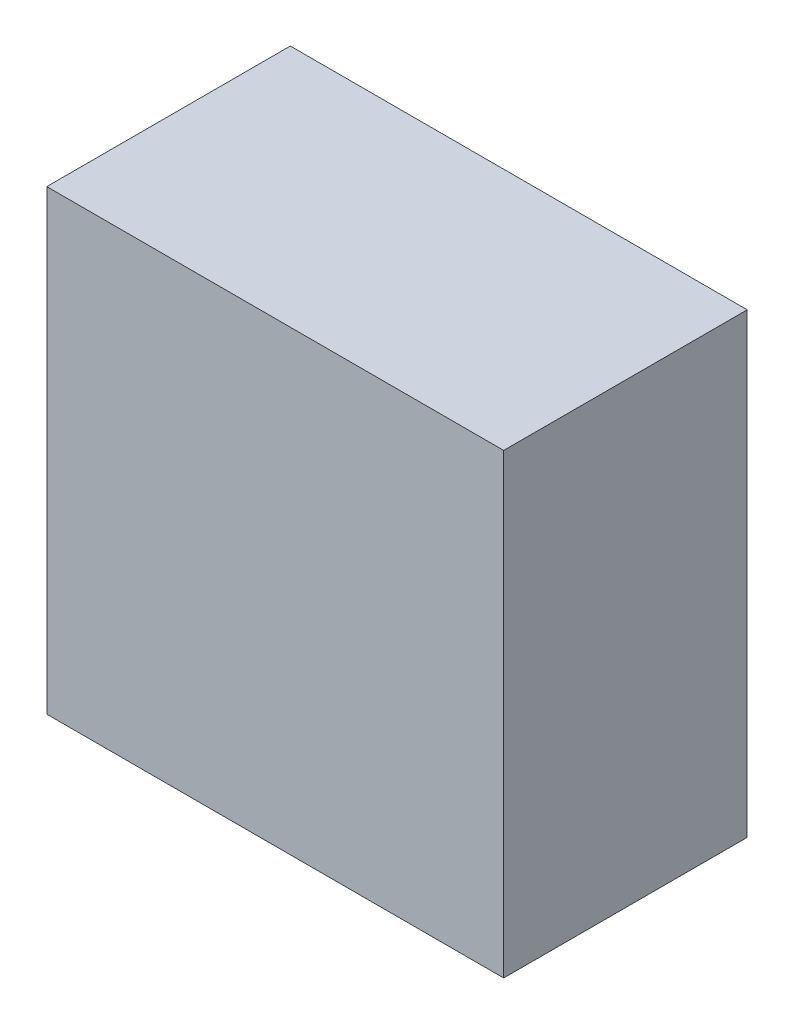
ISO-10303-21;
HEADER;
FILE_DESCRIPTION(('STEP AP214'),'2;1');
FILE_NAME('part.step','',(''),(''),'','','');
FILE_SCHEMA(('AUTOMOTIVE_DESIGN { 1 0 10303 214 1 1 1 1 }'));
ENDSEC;
DATA;
#1=APPLICATION_CONTEXT('core data for automotive mechanical design processes');
#2=APPLICATION_PROTOCOL_DEFINITION('international standard','automotive_design',2000,#1);
#3=PRODUCT_CONTEXT('',#1,'mechanical');
#4=PRODUCT('Part','Part','',(#3));
#5=PRODUCT_RELATED_PRODUCT_CATEGORY('part','',(#4));
#6=PRODUCT_DEFINITION_FORMATION('','',#4);
#7=PRODUCT_DEFINITION_CONTEXT('part definition',#1,'design');
#8=PRODUCT_DEFINITION('design','',#6,#7);
#9=PRODUCT_DEFINITION_SHAPE('','',#8);
#10=(LENGTH_UNIT() NAMED_UNIT(*) SI_UNIT(.MILLI.,.METRE.));
#11=(NAMED_UNIT(*) PLANE_ANGLE_UNIT() SI_UNIT($,.RADIAN.));
#12=(NAMED_UNIT(*) SI_UNIT($,.STERADIAN.) SOLID_ANGLE_UNIT());
#13=UNCERTAINTY_MEASURE_WITH_UNIT(LENGTH_MEASURE(1.E-05),#10,'distance_accuracy_value','');
#14=(GEOMETRIC_REPRESENTATION_CONTEXT(3) GLOBAL_UNCERTAINTY_ASSIGNED_CONTEXT((#13)) GLOBAL_UNIT_ASSIGNED_CONTEXT((#10,
#11,#12)) REPRESENTATION_CONTEXT('',''));
#15=CARTESIAN_POINT('',(0.,0.,0.));
#16=DIRECTION('',(0.,0.,1.));
#17=DIRECTION('',(1.,0.,0.));
#18=AXIS2_PLACEMENT_3D('',#15,#16,#17);
#19=CARTESIAN_POINT('',(0.499999,-0.499999,0.53300122));
#20=DIRECTION('',(0.,0.,1.));
#21=DIRECTION('',(1.,0.,0.));
#22=AXIS2_PLACEMENT_3D('',#19,#20,#21);
#23=PLANE('',#22);
#24=DIRECTION('',(-1.,0.,0.));
#25=VECTOR('',#24,1.);
#26=CARTESIAN_POINT('',(0.499999,-0.499999,0.53300122));
#27=LINE('',#26,#25);
#28=CARTESIAN_POINT('',(0.499999,-0.499999,0.53300122));
#29=VERTEX_POINT('',#28);
#30=CARTESIAN_POINT('',(-0.499999,-0.499999,0.53300122));
#31=VERTEX_POINT('',#30);
#32=EDGE_CURVE('E91',#29,#31,#27,.T.);
#33=ORIENTED_EDGE('',*,*,#32,.F.);
#34=DIRECTION('',(0.,-1.,0.));
#35=VECTOR('',#34,1.);
#36=CARTESIAN_POINT('',(0.499999,0.499999,0.53300122));
#37=LINE('',#36,#35);
#38=CARTESIAN_POINT('',(0.499999,0.499999,0.53300122));
#39=VERTEX_POINT('',#38);
#40=EDGE_CURVE('E28',#39,#29,#37,.T.);
#41=ORIENTED_EDGE('',*,*,#40,.F.);
#42=DIRECTION('',(1.,0.,0.));
#43=VECTOR('',#42,1.);
#44=CARTESIAN_POINT('',(-0.499999,0.499999,0.53300122));
#45=LINE('',#44,#43);
#46=CARTESIAN_POINT('',(-0.499999,0.499999,0.53300122));
#47=VERTEX_POINT('',#46);
#48=EDGE_CURVE('E84',#47,#39,#45,.T.);
#49=ORIENTED_EDGE('',*,*,#48,.F.);
#50=DIRECTION('',(0.,1.,0.));
#51=VECTOR('',#50,1.);
#52=CARTESIAN_POINT('',(-0.499999,-0.499999,0.53300122));
#53=LINE('',#52,#51);
#54=EDGE_CURVE('E66',#31,#47,#53,.T.);
#55=ORIENTED_EDGE('',*,*,#54,.F.);
#56=EDGE_LOOP('',(#33,#41,#49,#55));
#57=FACE_BOUND('',#56,.T.);
#58=ADVANCED_FACE('F17',(#57),#23,.T.);
#59=CARTESIAN_POINT('',(0.499999,-0.499999,0.));
#60=DIRECTION('',(0.,0.,1.));
#61=DIRECTION('',(1.,0.,0.));
#62=AXIS2_PLACEMENT_3D('',#59,#60,#61);
#63=PLANE('',#62);
#64=DIRECTION('',(-1.,0.,0.));
#65=VECTOR('',#64,1.);
#66=CARTESIAN_POINT('',(0.499999,-0.499999,0.));
#67=LINE('',#66,#65);
#68=CARTESIAN_POINT('',(0.499999,-0.499999,0.));
#69=VERTEX_POINT('',#68);
#70=CARTESIAN_POINT('',(-0.499999,-0.499999,0.));
#71=VERTEX_POINT('',#70);
#72=EDGE_CURVE('E21',#69,#71,#67,.T.);
#73=ORIENTED_EDGE('',*,*,#72,.T.);
#74=DIRECTION('',(0.,1.,0.));
#75=VECTOR('',#74,1.);
#76=CARTESIAN_POINT('',(-0.499999,-0.499999,0.));
#77=LINE('',#76,#75);
#78=CARTESIAN_POINT('',(-0.499999,0.499999,0.));
#79=VERTEX_POINT('',#78);
#80=EDGE_CURVE('E74',#71,#79,#77,.T.);
#81=ORIENTED_EDGE('',*,*,#80,.T.);
#82=DIRECTION('',(1.,0.,0.));
#83=VECTOR('',#82,1.);
#84=CARTESIAN_POINT('',(-0.499999,0.499999,0.));
#85=LINE('',#84,#83);
#86=CARTESIAN_POINT('',(0.499999,0.499999,0.));
#87=VERTEX_POINT('',#86);
#88=EDGE_CURVE('E105',#79,#87,#85,.T.);
#89=ORIENTED_EDGE('',*,*,#88,.T.);
#90=DIRECTION('',(0.,-1.,0.));
#91=VECTOR('',#90,1.);
#92=CARTESIAN_POINT('',(0.499999,0.499999,0.));
#93=LINE('',#92,#91);
#94=EDGE_CURVE('E11',#87,#69,#93,.T.);
#95=ORIENTED_EDGE('',*,*,#94,.T.);
#96=EDGE_LOOP('',(#73,#81,#89,#95));
#97=FACE_BOUND('',#96,.T.);
#98=ADVANCED_FACE('F19',(#97),#63,.F.);
#99=CARTESIAN_POINT('',(0.499999,0.499999,0.));
#100=DIRECTION('',(1.,0.,0.));
#101=DIRECTION('',(0.,1.,0.));
#102=AXIS2_PLACEMENT_3D('',#99,#100,#101);
#103=PLANE('',#102);
#104=DIRECTION('',(0.,0.,1.));
#105=VECTOR('',#104,1.);
#106=CARTESIAN_POINT('',(0.499999,0.499999,0.));
#107=LINE('',#106,#105);
#108=EDGE_CURVE('E114',#87,#39,#107,.T.);
#109=ORIENTED_EDGE('',*,*,#108,.T.);
#110=ORIENTED_EDGE('',*,*,#40,.T.);
#111=DIRECTION('',(0.,0.,1.));
#112=VECTOR('',#111,1.);
#113=CARTESIAN_POINT('',(0.499999,-0.499999,0.));
#114=LINE('',#113,#112);
#115=EDGE_CURVE('E98',#69,#29,#114,.T.);
#116=ORIENTED_EDGE('',*,*,#115,.F.);
#117=ORIENTED_EDGE('',*,*,#94,.F.);
#118=EDGE_LOOP('',(#109,#110,#116,#117));
#119=FACE_BOUND('',#118,.T.);
#120=ADVANCED_FACE('F126',(#119),#103,.T.);
#121=CARTESIAN_POINT('',(-0.499999,0.499999,0.));
#122=DIRECTION('',(0.,1.,0.));
#123=DIRECTION('',(1.,0.,0.));
#124=AXIS2_PLACEMENT_3D('',#121,#122,#123);
#125=PLANE('',#124);
#126=DIRECTION('',(0.,0.,1.));
#127=VECTOR('',#126,1.);
#128=CARTESIAN_POINT('',(-0.499999,0.499999,0.));
#129=LINE('',#128,#127);
#130=EDGE_CURVE('E81',#79,#47,#129,.T.);
#131=ORIENTED_EDGE('',*,*,#130,.T.);
#132=ORIENTED_EDGE('',*,*,#48,.T.);
#133=ORIENTED_EDGE('',*,*,#108,.F.);
#134=ORIENTED_EDGE('',*,*,#88,.F.);
#135=EDGE_LOOP('',(#131,#132,#133,#134));
#136=FACE_BOUND('',#135,.T.);
#137=ADVANCED_FACE('F112',(#136),#125,.T.);
#138=CARTESIAN_POINT('',(-0.499999,-0.499999,0.));
#139=DIRECTION('',(-1.,0.,0.));
#140=DIRECTION('',(0.,0.,1.));
#141=AXIS2_PLACEMENT_3D('',#138,#139,#140);
#142=PLANE('',#141);
#143=DIRECTION('',(0.,0.,1.));
#144=VECTOR('',#143,1.);
#145=CARTESIAN_POINT('',(-0.499999,-0.499999,0.));
#146=LINE('',#145,#144);
#147=EDGE_CURVE('E78',#71,#31,#146,.T.);
#148=ORIENTED_EDGE('',*,*,#147,.T.);
#149=ORIENTED_EDGE('',*,*,#54,.T.);
#150=ORIENTED_EDGE('',*,*,#130,.F.);
#151=ORIENTED_EDGE('',*,*,#80,.F.);
#152=EDGE_LOOP('',(#148,#149,#150,#151));
#153=FACE_BOUND('',#152,.T.);
#154=ADVANCED_FACE('F76',(#153),#142,.T.);
#155=CARTESIAN_POINT('',(0.499999,-0.499999,0.));
#156=DIRECTION('',(0.,-1.,0.));
#157=DIRECTION('',(0.,0.,-1.));
#158=AXIS2_PLACEMENT_3D('',#155,#156,#157);
#159=PLANE('',#158);
#160=ORIENTED_EDGE('',*,*,#115,.T.);
#161=ORIENTED_EDGE('',*,*,#32,.T.);
#162=ORIENTED_EDGE('',*,*,#147,.F.);
#163=ORIENTED_EDGE('',*,*,#72,.F.);
#164=EDGE_LOOP('',(#160,#161,#162,#163));
#165=FACE_BOUND('',#164,.T.);
#166=ADVANCED_FACE('F90',(#165),#159,.T.);
#167=CLOSED_SHELL('',(#58,#98,#120,#137,#154,#166));
#168=MANIFOLD_SOLID_BREP('B1',#167);
#169=ADVANCED_BREP_SHAPE_REPRESENTATION('',(#18,#168),#14);
#170=SHAPE_DEFINITION_REPRESENTATION(#9,#169);
ENDSEC;
END-ISO-10303-21;
